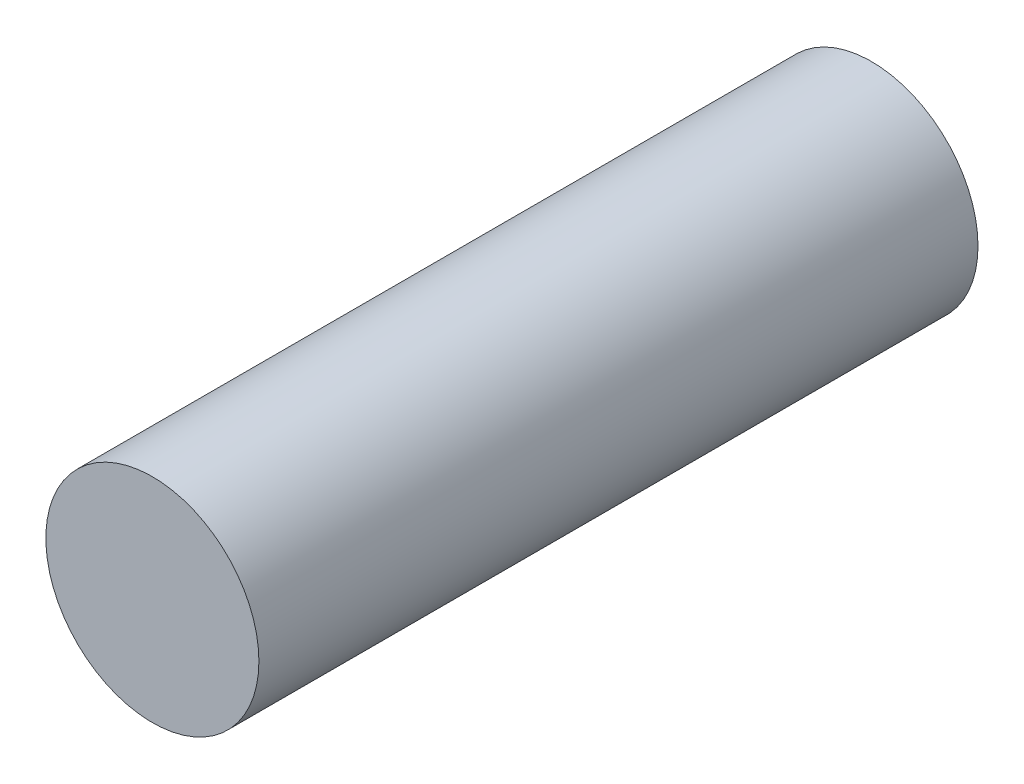
ISO-10303-21;
HEADER;
FILE_DESCRIPTION(('STEP AP214'),'2;1');
FILE_NAME('part.step','',(''),(''),'','','');
FILE_SCHEMA(('AUTOMOTIVE_DESIGN { 1 0 10303 214 1 1 1 1 }'));
ENDSEC;
DATA;
#1=APPLICATION_CONTEXT('core data for automotive mechanical design processes');
#2=APPLICATION_PROTOCOL_DEFINITION('international standard','automotive_design',2000,#1);
#3=PRODUCT_CONTEXT('',#1,'mechanical');
#4=PRODUCT('Part','Part','',(#3));
#5=PRODUCT_RELATED_PRODUCT_CATEGORY('part','',(#4));
#6=PRODUCT_DEFINITION_FORMATION('','',#4);
#7=PRODUCT_DEFINITION_CONTEXT('part definition',#1,'design');
#8=PRODUCT_DEFINITION('design','',#6,#7);
#9=PRODUCT_DEFINITION_SHAPE('','',#8);
#10=(LENGTH_UNIT() NAMED_UNIT(*) SI_UNIT(.MILLI.,.METRE.));
#11=(NAMED_UNIT(*) PLANE_ANGLE_UNIT() SI_UNIT($,.RADIAN.));
#12=(NAMED_UNIT(*) SI_UNIT($,.STERADIAN.) SOLID_ANGLE_UNIT());
#13=UNCERTAINTY_MEASURE_WITH_UNIT(LENGTH_MEASURE(1.E-05),#10,'distance_accuracy_value','');
#14=(GEOMETRIC_REPRESENTATION_CONTEXT(3) GLOBAL_UNCERTAINTY_ASSIGNED_CONTEXT((#13)) GLOBAL_UNIT_ASSIGNED_CONTEXT((#10,
#11,#12)) REPRESENTATION_CONTEXT('',''));
#15=CARTESIAN_POINT('',(0.,0.,0.));
#16=DIRECTION('',(0.,0.,1.));
#17=DIRECTION('',(1.,0.,0.));
#18=AXIS2_PLACEMENT_3D('',#15,#16,#17);
#19=CARTESIAN_POINT('',(0.,0.,27.));
#20=DIRECTION('',(0.,0.,-1.));
#21=DIRECTION('',(-1.,0.,0.));
#22=AXIS2_PLACEMENT_3D('',#19,#20,#21);
#23=CYLINDRICAL_SURFACE('',#22,4.);
#24=CARTESIAN_POINT('',(0.,0.,27.));
#25=DIRECTION('',(0.,0.,1.));
#26=DIRECTION('',(1.,0.,0.));
#27=AXIS2_PLACEMENT_3D('',#24,#25,#26);
#28=CIRCLE('',#27,4.);
#29=CARTESIAN_POINT('',(4.,0.,27.));
#30=VERTEX_POINT('',#29);
#31=EDGE_CURVE('E10',#30,#30,#28,.T.);
#32=ORIENTED_EDGE('',*,*,#31,.F.);
#33=EDGE_LOOP('',(#32));
#34=FACE_BOUND('',#33,.T.);
#35=CARTESIAN_POINT('',(0.,0.,0.));
#36=DIRECTION('',(0.,0.,1.));
#37=DIRECTION('',(1.,0.,0.));
#38=AXIS2_PLACEMENT_3D('',#35,#36,#37);
#39=CIRCLE('',#38,4.);
#40=CARTESIAN_POINT('',(4.,0.,0.));
#41=VERTEX_POINT('',#40);
#42=EDGE_CURVE('E40',#41,#41,#39,.T.);
#43=ORIENTED_EDGE('',*,*,#42,.T.);
#44=EDGE_LOOP('',(#43));
#45=FACE_BOUND('',#44,.T.);
#46=ADVANCED_FACE('F37',(#34,#45),#23,.T.);
#47=CARTESIAN_POINT('',(0.,0.,27.));
#48=DIRECTION('',(0.,0.,1.));
#49=DIRECTION('',(1.,0.,0.));
#50=AXIS2_PLACEMENT_3D('',#47,#48,#49);
#51=PLANE('',#50);
#52=ORIENTED_EDGE('',*,*,#31,.T.);
#53=EDGE_LOOP('',(#52));
#54=FACE_BOUND('',#53,.T.);
#55=ADVANCED_FACE('F54',(#54),#51,.T.);
#56=CARTESIAN_POINT('',(0.,0.,0.));
#57=DIRECTION('',(0.,0.,1.));
#58=DIRECTION('',(1.,0.,0.));
#59=AXIS2_PLACEMENT_3D('',#56,#57,#58);
#60=PLANE('',#59);
#61=ORIENTED_EDGE('',*,*,#42,.F.);
#62=EDGE_LOOP('',(#61));
#63=FACE_BOUND('',#62,.T.);
#64=ADVANCED_FACE('F52',(#63),#60,.F.);
#65=CLOSED_SHELL('',(#46,#55,#64));
#66=MANIFOLD_SOLID_BREP('B2',#65);
#67=ADVANCED_BREP_SHAPE_REPRESENTATION('',(#18,#66),#14);
#68=SHAPE_DEFINITION_REPRESENTATION(#9,#67);
ENDSEC;
END-ISO-10303-21;
